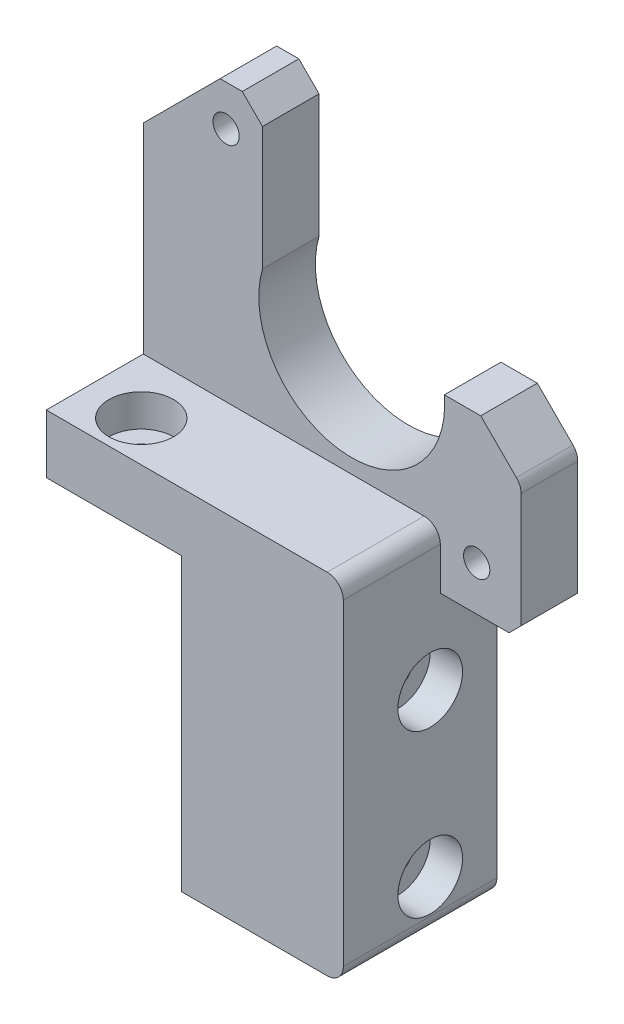
ISO-10303-21;
HEADER;
FILE_DESCRIPTION(('STEP AP214'),'2;1');
FILE_NAME('part.step','',(''),(''),'','','');
FILE_SCHEMA(('AUTOMOTIVE_DESIGN { 1 0 10303 214 1 1 1 1 }'));
ENDSEC;
DATA;
#1=APPLICATION_CONTEXT('core data for automotive mechanical design processes');
#2=APPLICATION_PROTOCOL_DEFINITION('international standard','automotive_design',2000,#1);
#3=PRODUCT_CONTEXT('',#1,'mechanical');
#4=PRODUCT('Part','Part','',(#3));
#5=PRODUCT_RELATED_PRODUCT_CATEGORY('part','',(#4));
#6=PRODUCT_DEFINITION_FORMATION('','',#4);
#7=PRODUCT_DEFINITION_CONTEXT('part definition',#1,'design');
#8=PRODUCT_DEFINITION('design','',#6,#7);
#9=PRODUCT_DEFINITION_SHAPE('','',#8);
#10=(LENGTH_UNIT() NAMED_UNIT(*) SI_UNIT(.MILLI.,.METRE.));
#11=(NAMED_UNIT(*) PLANE_ANGLE_UNIT() SI_UNIT($,.RADIAN.));
#12=(NAMED_UNIT(*) SI_UNIT($,.STERADIAN.) SOLID_ANGLE_UNIT());
#13=UNCERTAINTY_MEASURE_WITH_UNIT(LENGTH_MEASURE(1.E-05),#10,'distance_accuracy_value','');
#14=(GEOMETRIC_REPRESENTATION_CONTEXT(3) GLOBAL_UNCERTAINTY_ASSIGNED_CONTEXT((#13)) GLOBAL_UNIT_ASSIGNED_CONTEXT((#10,
#11,#12)) REPRESENTATION_CONTEXT('',''));
#15=CARTESIAN_POINT('',(0.,0.,0.));
#16=DIRECTION('',(0.,0.,1.));
#17=DIRECTION('',(1.,0.,0.));
#18=AXIS2_PLACEMENT_3D('',#15,#16,#17);
#19=CARTESIAN_POINT('',(-10.,46.,14.));
#20=DIRECTION('',(0.,-1.,0.));
#21=DIRECTION('',(0.,0.,-1.));
#22=AXIS2_PLACEMENT_3D('',#19,#20,#21);
#23=CYLINDRICAL_SURFACE('',#22,1.75);
#24=CARTESIAN_POINT('',(-10.,36.,14.));
#25=DIRECTION('',(0.,-1.,0.));
#26=DIRECTION('',(0.,0.,-1.));
#27=AXIS2_PLACEMENT_3D('',#24,#25,#26);
#28=CIRCLE('',#27,1.75);
#29=CARTESIAN_POINT('',(-10.,36.,12.25));
#30=VERTEX_POINT('',#29);
#31=EDGE_CURVE('E490',#30,#30,#28,.T.);
#32=ORIENTED_EDGE('',*,*,#31,.T.);
#33=EDGE_LOOP('',(#32));
#34=FACE_BOUND('',#33,.T.);
#35=CARTESIAN_POINT('',(-10.,39.25,14.));
#36=DIRECTION('',(0.,1.,0.));
#37=DIRECTION('',(-1.,0.,0.));
#38=AXIS2_PLACEMENT_3D('',#35,#36,#37);
#39=CIRCLE('',#38,1.75);
#40=CARTESIAN_POINT('',(-11.75,39.25,14.));
#41=VERTEX_POINT('',#40);
#42=EDGE_CURVE('E39',#41,#41,#39,.F.);
#43=ORIENTED_EDGE('',*,*,#42,.F.);
#44=EDGE_LOOP('',(#43));
#45=FACE_BOUND('',#44,.T.);
#46=ADVANCED_FACE('F35',(#34,#45),#23,.F.);
#47=CARTESIAN_POINT('',(-16.75,6.25000000000001,8.25));
#48=DIRECTION('',(1.,0.,0.));
#49=DIRECTION('',(0.,0.,-1.));
#50=AXIS2_PLACEMENT_3D('',#47,#48,#49);
#51=CYLINDRICAL_SURFACE('',#50,1.75);
#52=CARTESIAN_POINT('',(0.,6.25000000000001,8.25));
#53=DIRECTION('',(1.,0.,0.));
#54=DIRECTION('',(0.,1.,0.));
#55=AXIS2_PLACEMENT_3D('',#52,#53,#54);
#56=CIRCLE('',#55,1.75);
#57=CARTESIAN_POINT('',(0.,8.00000000000001,8.25));
#58=VERTEX_POINT('',#57);
#59=EDGE_CURVE('E321',#58,#58,#56,.T.);
#60=ORIENTED_EDGE('',*,*,#59,.F.);
#61=EDGE_LOOP('',(#60));
#62=FACE_BOUND('',#61,.T.);
#63=CARTESIAN_POINT('',(16.,6.25000000000001,8.25));
#64=DIRECTION('',(1.,0.,0.));
#65=DIRECTION('',(0.,0.,-1.));
#66=AXIS2_PLACEMENT_3D('',#63,#64,#65);
#67=CIRCLE('',#66,1.75);
#68=CARTESIAN_POINT('',(16.,6.25000000000001,6.5));
#69=VERTEX_POINT('',#68);
#70=EDGE_CURVE('E317',#69,#69,#67,.F.);
#71=ORIENTED_EDGE('',*,*,#70,.F.);
#72=EDGE_LOOP('',(#71));
#73=FACE_BOUND('',#72,.T.);
#74=ADVANCED_FACE('F398',(#62,#73),#51,.F.);
#75=CARTESIAN_POINT('',(-16.75,26.25,8.25));
#76=DIRECTION('',(1.,0.,0.));
#77=DIRECTION('',(0.,0.,-1.));
#78=AXIS2_PLACEMENT_3D('',#75,#76,#77);
#79=CYLINDRICAL_SURFACE('',#78,1.75);
#80=CARTESIAN_POINT('',(0.,26.25,8.25));
#81=DIRECTION('',(1.,0.,0.));
#82=DIRECTION('',(0.,1.,0.));
#83=AXIS2_PLACEMENT_3D('',#80,#81,#82);
#84=CIRCLE('',#83,1.75);
#85=CARTESIAN_POINT('',(0.,28.,8.25));
#86=VERTEX_POINT('',#85);
#87=EDGE_CURVE('E228',#86,#86,#84,.T.);
#88=ORIENTED_EDGE('',*,*,#87,.F.);
#89=EDGE_LOOP('',(#88));
#90=FACE_BOUND('',#89,.T.);
#91=CARTESIAN_POINT('',(16.,26.25,8.25));
#92=DIRECTION('',(1.,0.,0.));
#93=DIRECTION('',(0.,0.,-1.));
#94=AXIS2_PLACEMENT_3D('',#91,#92,#93);
#95=CIRCLE('',#94,1.75);
#96=CARTESIAN_POINT('',(16.,26.25,6.5));
#97=VERTEX_POINT('',#96);
#98=EDGE_CURVE('E314',#97,#97,#95,.F.);
#99=ORIENTED_EDGE('',*,*,#98,.F.);
#100=EDGE_LOOP('',(#99));
#101=FACE_BOUND('',#100,.T.);
#102=ADVANCED_FACE('F405',(#90,#101),#79,.F.);
#103=CARTESIAN_POINT('',(20.,43.25,19.));
#104=DIRECTION('',(0.,-1.,0.));
#105=DIRECTION('',(1.,0.,0.));
#106=AXIS2_PLACEMENT_3D('',#103,#104,#105);
#107=PLANE('',#106);
#108=CARTESIAN_POINT('',(-10.,43.25,14.));
#109=DIRECTION('',(0.,1.,0.));
#110=DIRECTION('',(-1.,0.,0.));
#111=AXIS2_PLACEMENT_3D('',#108,#109,#110);
#112=CIRCLE('',#111,4.);
#113=CARTESIAN_POINT('',(-14.,43.25,14.));
#114=VERTEX_POINT('',#113);
#115=EDGE_CURVE('E547',#114,#114,#112,.T.);
#116=ORIENTED_EDGE('',*,*,#115,.F.);
#117=EDGE_LOOP('',(#116));
#118=FACE_BOUND('',#117,.T.);
#119=DIRECTION('',(-1.,0.,0.));
#120=VECTOR('',#119,1.);
#121=CARTESIAN_POINT('',(20.,43.25,19.));
#122=LINE('',#121,#120);
#123=CARTESIAN_POINT('',(18.,43.25,19.));
#124=VERTEX_POINT('',#123);
#125=CARTESIAN_POINT('',(-16.75,43.25,19.));
#126=VERTEX_POINT('',#125);
#127=EDGE_CURVE('E288',#124,#126,#122,.T.);
#128=ORIENTED_EDGE('',*,*,#127,.F.);
#129=DIRECTION('',(0.,0.,-1.));
#130=VECTOR('',#129,1.);
#131=CARTESIAN_POINT('',(18.,43.25,19.));
#132=LINE('',#131,#130);
#133=CARTESIAN_POINT('',(18.,43.25,7.));
#134=VERTEX_POINT('',#133);
#135=EDGE_CURVE('E44',#124,#134,#132,.T.);
#136=ORIENTED_EDGE('',*,*,#135,.T.);
#137=DIRECTION('',(1.,0.,0.));
#138=VECTOR('',#137,1.);
#139=CARTESIAN_POINT('',(20.,43.25,7.));
#140=LINE('',#139,#138);
#141=CARTESIAN_POINT('',(-16.75,43.25,7.));
#142=VERTEX_POINT('',#141);
#143=EDGE_CURVE('E273',#142,#134,#140,.T.);
#144=ORIENTED_EDGE('',*,*,#143,.F.);
#145=DIRECTION('',(0.,0.,-1.));
#146=VECTOR('',#145,1.);
#147=CARTESIAN_POINT('',(-16.75,43.25,19.));
#148=LINE('',#147,#146);
#149=EDGE_CURVE('E182',#126,#142,#148,.T.);
#150=ORIENTED_EDGE('',*,*,#149,.F.);
#151=EDGE_LOOP('',(#128,#136,#144,#150));
#152=FACE_BOUND('',#151,.T.);
#153=ADVANCED_FACE('F352',(#118,#152),#107,.F.);
#154=CARTESIAN_POINT('',(0.,36.,19.));
#155=DIRECTION('',(1.,0.,0.));
#156=DIRECTION('',(0.,1.,0.));
#157=AXIS2_PLACEMENT_3D('',#154,#155,#156);
#158=PLANE('',#157);
#159=ORIENTED_EDGE('',*,*,#87,.T.);
#160=EDGE_LOOP('',(#159));
#161=FACE_BOUND('',#160,.T.);
#162=ORIENTED_EDGE('',*,*,#59,.T.);
#163=EDGE_LOOP('',(#162));
#164=FACE_BOUND('',#163,.T.);
#165=DIRECTION('',(0.,-1.,0.));
#166=VECTOR('',#165,1.);
#167=CARTESIAN_POINT('',(0.,36.,0.));
#168=LINE('',#167,#166);
#169=CARTESIAN_POINT('',(0.,36.,0.));
#170=VERTEX_POINT('',#169);
#171=CARTESIAN_POINT('',(0.,0.,0.));
#172=VERTEX_POINT('',#171);
#173=EDGE_CURVE('E277',#170,#172,#168,.T.);
#174=ORIENTED_EDGE('',*,*,#173,.T.);
#175=DIRECTION('',(0.,0.,-1.));
#176=VECTOR('',#175,1.);
#177=CARTESIAN_POINT('',(0.,0.,19.));
#178=LINE('',#177,#176);
#179=CARTESIAN_POINT('',(0.,0.,19.));
#180=VERTEX_POINT('',#179);
#181=EDGE_CURVE('E310',#180,#172,#178,.T.);
#182=ORIENTED_EDGE('',*,*,#181,.F.);
#183=DIRECTION('',(0.,-1.,0.));
#184=VECTOR('',#183,1.);
#185=CARTESIAN_POINT('',(0.,36.,19.));
#186=LINE('',#185,#184);
#187=CARTESIAN_POINT('',(0.,36.,19.));
#188=VERTEX_POINT('',#187);
#189=EDGE_CURVE('E278',#188,#180,#186,.T.);
#190=ORIENTED_EDGE('',*,*,#189,.F.);
#191=DIRECTION('',(0.,0.,-1.));
#192=VECTOR('',#191,1.);
#193=CARTESIAN_POINT('',(0.,36.,19.));
#194=LINE('',#193,#192);
#195=EDGE_CURVE('E294',#188,#170,#194,.T.);
#196=ORIENTED_EDGE('',*,*,#195,.T.);
#197=EDGE_LOOP('',(#174,#182,#190,#196));
#198=FACE_BOUND('',#197,.T.);
#199=ADVANCED_FACE('F377',(#161,#164,#198),#158,.F.);
#200=CARTESIAN_POINT('',(0.,0.,19.));
#201=DIRECTION('',(0.,1.,0.));
#202=DIRECTION('',(0.,0.,1.));
#203=AXIS2_PLACEMENT_3D('',#200,#201,#202);
#204=PLANE('',#203);
#205=DIRECTION('',(1.,0.,0.));
#206=VECTOR('',#205,1.);
#207=CARTESIAN_POINT('',(0.,0.,0.));
#208=LINE('',#207,#206);
#209=CARTESIAN_POINT('',(18.,0.,0.));
#210=VERTEX_POINT('',#209);
#211=EDGE_CURVE('E297',#172,#210,#208,.T.);
#212=ORIENTED_EDGE('',*,*,#211,.T.);
#213=DIRECTION('',(0.,0.,-1.));
#214=VECTOR('',#213,1.);
#215=CARTESIAN_POINT('',(18.,0.,19.));
#216=LINE('',#215,#214);
#217=CARTESIAN_POINT('',(18.,0.,19.));
#218=VERTEX_POINT('',#217);
#219=EDGE_CURVE('E338',#210,#218,#216,.F.);
#220=ORIENTED_EDGE('',*,*,#219,.T.);
#221=DIRECTION('',(1.,0.,0.));
#222=VECTOR('',#221,1.);
#223=CARTESIAN_POINT('',(0.,0.,19.));
#224=LINE('',#223,#222);
#225=EDGE_CURVE('E281',#180,#218,#224,.T.);
#226=ORIENTED_EDGE('',*,*,#225,.F.);
#227=ORIENTED_EDGE('',*,*,#181,.T.);
#228=EDGE_LOOP('',(#212,#220,#226,#227));
#229=FACE_BOUND('',#228,.T.);
#230=ADVANCED_FACE('F373',(#229),#204,.F.);
#231=CARTESIAN_POINT('',(20.,0.,19.));
#232=DIRECTION('',(-1.,0.,0.));
#233=DIRECTION('',(0.,0.,1.));
#234=AXIS2_PLACEMENT_3D('',#231,#232,#233);
#235=PLANE('',#234);
#236=CARTESIAN_POINT('',(20.,26.25,8.25));
#237=DIRECTION('',(1.,0.,0.));
#238=DIRECTION('',(0.,0.,-1.));
#239=AXIS2_PLACEMENT_3D('',#236,#237,#238);
#240=CIRCLE('',#239,4.);
#241=CARTESIAN_POINT('',(20.,26.25,4.25));
#242=VERTEX_POINT('',#241);
#243=EDGE_CURVE('E497',#242,#242,#240,.T.);
#244=ORIENTED_EDGE('',*,*,#243,.F.);
#245=EDGE_LOOP('',(#244));
#246=FACE_BOUND('',#245,.T.);
#247=CARTESIAN_POINT('',(20.,6.25000000000001,8.25));
#248=DIRECTION('',(1.,0.,0.));
#249=DIRECTION('',(0.,0.,-1.));
#250=AXIS2_PLACEMENT_3D('',#247,#248,#249);
#251=CIRCLE('',#250,4.);
#252=CARTESIAN_POINT('',(20.,6.25000000000001,4.25));
#253=VERTEX_POINT('',#252);
#254=EDGE_CURVE('E329',#253,#253,#251,.T.);
#255=ORIENTED_EDGE('',*,*,#254,.F.);
#256=EDGE_LOOP('',(#255));
#257=FACE_BOUND('',#256,.T.);
#258=DIRECTION('',(0.,1.,0.));
#259=VECTOR('',#258,1.);
#260=CARTESIAN_POINT('',(20.,0.,19.));
#261=LINE('',#260,#259);
#262=CARTESIAN_POINT('',(20.,2.,19.));
#263=VERTEX_POINT('',#262);
#264=CARTESIAN_POINT('',(20.,41.25,19.));
#265=VERTEX_POINT('',#264);
#266=EDGE_CURVE('E285',#263,#265,#261,.T.);
#267=ORIENTED_EDGE('',*,*,#266,.F.);
#268=DIRECTION('',(0.,0.,-1.));
#269=VECTOR('',#268,1.);
#270=CARTESIAN_POINT('',(20.,2.,19.));
#271=LINE('',#270,#269);
#272=CARTESIAN_POINT('',(20.,2.00000000000002,0.));
#273=VERTEX_POINT('',#272);
#274=EDGE_CURVE('E331',#263,#273,#271,.T.);
#275=ORIENTED_EDGE('',*,*,#274,.T.);
#276=DIRECTION('',(0.,1.,0.));
#277=VECTOR('',#276,1.);
#278=CARTESIAN_POINT('',(20.,0.,0.));
#279=LINE('',#278,#277);
#280=CARTESIAN_POINT('',(20.,36.,0.));
#281=VERTEX_POINT('',#280);
#282=EDGE_CURVE('E300',#273,#281,#279,.T.);
#283=ORIENTED_EDGE('',*,*,#282,.T.);
#284=DIRECTION('',(0.,0.,1.));
#285=VECTOR('',#284,1.);
#286=CARTESIAN_POINT('',(20.,36.,19.));
#287=LINE('',#286,#285);
#288=CARTESIAN_POINT('',(20.,36.,7.));
#289=VERTEX_POINT('',#288);
#290=EDGE_CURVE('E256',#281,#289,#287,.T.);
#291=ORIENTED_EDGE('',*,*,#290,.T.);
#292=DIRECTION('',(0.,-1.,0.));
#293=VECTOR('',#292,1.);
#294=CARTESIAN_POINT('',(20.,0.,7.));
#295=LINE('',#294,#293);
#296=CARTESIAN_POINT('',(20.,41.25,7.));
#297=VERTEX_POINT('',#296);
#298=EDGE_CURVE('E275',#297,#289,#295,.T.);
#299=ORIENTED_EDGE('',*,*,#298,.F.);
#300=DIRECTION('',(0.,0.,-1.));
#301=VECTOR('',#300,1.);
#302=CARTESIAN_POINT('',(20.,41.25,19.));
#303=LINE('',#302,#301);
#304=EDGE_CURVE('E313',#297,#265,#303,.F.);
#305=ORIENTED_EDGE('',*,*,#304,.T.);
#306=EDGE_LOOP('',(#267,#275,#283,#291,#299,#305));
#307=FACE_BOUND('',#306,.T.);
#308=ADVANCED_FACE('F358',(#246,#257,#307),#235,.F.);
#309=CARTESIAN_POINT('',(-16.75,43.25,19.));
#310=DIRECTION('',(1.,0.,0.));
#311=DIRECTION('',(0.,1.,0.));
#312=AXIS2_PLACEMENT_3D('',#309,#310,#311);
#313=PLANE('',#312);
#314=DIRECTION('',(0.,-1.,0.));
#315=VECTOR('',#314,1.);
#316=CARTESIAN_POINT('',(-16.75,43.25,0.));
#317=LINE('',#316,#315);
#318=CARTESIAN_POINT('',(-16.75,68.,0.));
#319=VERTEX_POINT('',#318);
#320=CARTESIAN_POINT('',(-16.75,36.,0.));
#321=VERTEX_POINT('',#320);
#322=EDGE_CURVE('E302',#319,#321,#317,.T.);
#323=ORIENTED_EDGE('',*,*,#322,.T.);
#324=DIRECTION('',(0.,0.,-1.));
#325=VECTOR('',#324,1.);
#326=CARTESIAN_POINT('',(-16.75,36.,19.));
#327=LINE('',#326,#325);
#328=CARTESIAN_POINT('',(-16.75,36.,19.));
#329=VERTEX_POINT('',#328);
#330=EDGE_CURVE('E307',#329,#321,#327,.T.);
#331=ORIENTED_EDGE('',*,*,#330,.F.);
#332=DIRECTION('',(0.,-1.,0.));
#333=VECTOR('',#332,1.);
#334=CARTESIAN_POINT('',(-16.75,43.25,19.));
#335=LINE('',#334,#333);
#336=EDGE_CURVE('E290',#126,#329,#335,.T.);
#337=ORIENTED_EDGE('',*,*,#336,.F.);
#338=ORIENTED_EDGE('',*,*,#149,.T.);
#339=DIRECTION('',(0.,1.,0.));
#340=VECTOR('',#339,1.);
#341=CARTESIAN_POINT('',(-16.75,36.,7.));
#342=LINE('',#341,#340);
#343=CARTESIAN_POINT('',(-16.75,68.,7.));
#344=VERTEX_POINT('',#343);
#345=EDGE_CURVE('E174',#142,#344,#342,.T.);
#346=ORIENTED_EDGE('',*,*,#345,.T.);
#347=DIRECTION('',(0.,0.,-1.));
#348=VECTOR('',#347,1.);
#349=CARTESIAN_POINT('',(-16.75,68.,7.));
#350=LINE('',#349,#348);
#351=EDGE_CURVE('E178',#344,#319,#350,.T.);
#352=ORIENTED_EDGE('',*,*,#351,.T.);
#353=EDGE_LOOP('',(#323,#331,#337,#338,#346,#352));
#354=FACE_BOUND('',#353,.T.);
#355=ADVANCED_FACE('F177',(#354),#313,.F.);
#356=CARTESIAN_POINT('',(-16.75,36.,19.));
#357=DIRECTION('',(0.,1.,0.));
#358=DIRECTION('',(0.,0.,1.));
#359=AXIS2_PLACEMENT_3D('',#356,#357,#358);
#360=PLANE('',#359);
#361=ORIENTED_EDGE('',*,*,#31,.F.);
#362=EDGE_LOOP('',(#361));
#363=FACE_BOUND('',#362,.T.);
#364=DIRECTION('',(1.,0.,0.));
#365=VECTOR('',#364,1.);
#366=CARTESIAN_POINT('',(-16.75,36.,0.));
#367=LINE('',#366,#365);
#368=EDGE_CURVE('E282',#321,#170,#367,.T.);
#369=ORIENTED_EDGE('',*,*,#368,.T.);
#370=ORIENTED_EDGE('',*,*,#195,.F.);
#371=DIRECTION('',(1.,0.,0.));
#372=VECTOR('',#371,1.);
#373=CARTESIAN_POINT('',(-16.75,36.,19.));
#374=LINE('',#373,#372);
#375=EDGE_CURVE('E292',#329,#188,#374,.T.);
#376=ORIENTED_EDGE('',*,*,#375,.F.);
#377=ORIENTED_EDGE('',*,*,#330,.T.);
#378=EDGE_LOOP('',(#369,#370,#376,#377));
#379=FACE_BOUND('',#378,.T.);
#380=ADVANCED_FACE('F381',(#363,#379),#360,.F.);
#381=CARTESIAN_POINT('',(0.,0.,19.));
#382=DIRECTION('',(0.,0.,1.));
#383=DIRECTION('',(1.,0.,0.));
#384=AXIS2_PLACEMENT_3D('',#381,#382,#383);
#385=PLANE('',#384);
#386=ORIENTED_EDGE('',*,*,#225,.T.);
#387=CARTESIAN_POINT('',(18.,2.,19.));
#388=DIRECTION('',(0.,0.,1.));
#389=DIRECTION('',(1.,0.,0.));
#390=AXIS2_PLACEMENT_3D('',#387,#388,#389);
#391=CIRCLE('',#390,2.);
#392=EDGE_CURVE('E342',#218,#263,#391,.T.);
#393=ORIENTED_EDGE('',*,*,#392,.T.);
#394=ORIENTED_EDGE('',*,*,#266,.T.);
#395=CARTESIAN_POINT('',(18.,41.25,19.));
#396=DIRECTION('',(0.,0.,1.));
#397=DIRECTION('',(1.,0.,0.));
#398=AXIS2_PLACEMENT_3D('',#395,#396,#397);
#399=CIRCLE('',#398,2.);
#400=EDGE_CURVE('E340',#265,#124,#399,.T.);
#401=ORIENTED_EDGE('',*,*,#400,.T.);
#402=ORIENTED_EDGE('',*,*,#127,.T.);
#403=ORIENTED_EDGE('',*,*,#336,.T.);
#404=ORIENTED_EDGE('',*,*,#375,.T.);
#405=ORIENTED_EDGE('',*,*,#189,.T.);
#406=EDGE_LOOP('',(#386,#393,#394,#401,#402,#403,#404,#405));
#407=FACE_BOUND('',#406,.T.);
#408=ADVANCED_FACE('F362',(#407),#385,.T.);
#409=CARTESIAN_POINT('',(0.,0.,0.));
#410=DIRECTION('',(0.,0.,1.));
#411=DIRECTION('',(1.,0.,0.));
#412=AXIS2_PLACEMENT_3D('',#409,#410,#411);
#413=PLANE('',#412);
#414=CARTESIAN_POINT('',(-6.49999999999999,72.5,0.));
#415=DIRECTION('',(0.,0.,-1.));
#416=DIRECTION('',(-1.,0.,0.));
#417=AXIS2_PLACEMENT_3D('',#414,#415,#416);
#418=CIRCLE('',#417,1.625);
#419=CARTESIAN_POINT('',(-8.12499999999999,72.5,0.));
#420=VERTEX_POINT('',#419);
#421=EDGE_CURVE('E326',#420,#420,#418,.T.);
#422=ORIENTED_EDGE('',*,*,#421,.F.);
#423=EDGE_LOOP('',(#422));
#424=FACE_BOUND('',#423,.T.);
#425=CARTESIAN_POINT('',(24.5,41.5,0.));
#426=DIRECTION('',(0.,0.,-1.));
#427=DIRECTION('',(-1.,0.,0.));
#428=AXIS2_PLACEMENT_3D('',#425,#426,#427);
#429=CIRCLE('',#428,1.625);
#430=CARTESIAN_POINT('',(22.875,41.5,0.));
#431=VERTEX_POINT('',#430);
#432=EDGE_CURVE('E489',#431,#431,#429,.T.);
#433=ORIENTED_EDGE('',*,*,#432,.F.);
#434=EDGE_LOOP('',(#433));
#435=FACE_BOUND('',#434,.T.);
#436=ORIENTED_EDGE('',*,*,#282,.F.);
#437=CARTESIAN_POINT('',(18.,2.00000000000002,0.));
#438=DIRECTION('',(0.,0.,1.));
#439=DIRECTION('',(1.,0.,0.));
#440=AXIS2_PLACEMENT_3D('',#437,#438,#439);
#441=CIRCLE('',#440,2.);
#442=EDGE_CURVE('E336',#273,#210,#441,.F.);
#443=ORIENTED_EDGE('',*,*,#442,.T.);
#444=ORIENTED_EDGE('',*,*,#211,.F.);
#445=ORIENTED_EDGE('',*,*,#173,.F.);
#446=ORIENTED_EDGE('',*,*,#368,.F.);
#447=ORIENTED_EDGE('',*,*,#322,.F.);
#448=DIRECTION('',(0.707106781186549,0.707106781186546,0.));
#449=VECTOR('',#448,1.);
#450=CARTESIAN_POINT('',(-16.75,68.,0.));
#451=LINE('',#450,#449);
#452=CARTESIAN_POINT('',(-7.24999999999997,77.5,0.));
#453=VERTEX_POINT('',#452);
#454=EDGE_CURVE('E193',#319,#453,#451,.T.);
#455=ORIENTED_EDGE('',*,*,#454,.T.);
#456=DIRECTION('',(1.,0.,0.));
#457=VECTOR('',#456,1.);
#458=CARTESIAN_POINT('',(-7.24999999999997,77.5,0.));
#459=LINE('',#458,#457);
#460=CARTESIAN_POINT('',(-4.49999999999997,77.5,0.));
#461=VERTEX_POINT('',#460);
#462=EDGE_CURVE('E230',#453,#461,#459,.T.);
#463=ORIENTED_EDGE('',*,*,#462,.T.);
#464=DIRECTION('',(0.707106781186545,-0.70710678118655,0.));
#465=VECTOR('',#464,1.);
#466=CARTESIAN_POINT('',(-4.49999999999997,77.5,0.));
#467=LINE('',#466,#465);
#468=CARTESIAN_POINT('',(-1.99999999999998,75.,0.));
#469=VERTEX_POINT('',#468);
#470=EDGE_CURVE('E233',#461,#469,#467,.T.);
#471=ORIENTED_EDGE('',*,*,#470,.T.);
#472=DIRECTION('',(0.,-1.,0.));
#473=VECTOR('',#472,1.);
#474=CARTESIAN_POINT('',(-1.99999999999998,75.,0.));
#475=LINE('',#474,#473);
#476=CARTESIAN_POINT('',(-1.99999999999998,59.75,0.));
#477=VERTEX_POINT('',#476);
#478=EDGE_CURVE('E236',#469,#477,#475,.T.);
#479=ORIENTED_EDGE('',*,*,#478,.T.);
#480=CARTESIAN_POINT('',(9.04076104427223,56.532610442722,0.));
#481=DIRECTION('',(0.,0.,1.));
#482=DIRECTION('',(-1.,0.,0.));
#483=AXIS2_PLACEMENT_3D('',#480,#481,#482);
#484=CIRCLE('',#483,11.5);
#485=CARTESIAN_POINT('',(20.5,57.5,0.));
#486=VERTEX_POINT('',#485);
#487=EDGE_CURVE('E239',#477,#486,#484,.T.);
#488=ORIENTED_EDGE('',*,*,#487,.T.);
#489=DIRECTION('',(1.,0.,0.));
#490=VECTOR('',#489,1.);
#491=CARTESIAN_POINT('',(25.,57.5,0.));
#492=LINE('',#491,#490);
#493=CARTESIAN_POINT('',(25.,57.5,0.));
#494=VERTEX_POINT('',#493);
#495=EDGE_CURVE('E242',#486,#494,#492,.T.);
#496=ORIENTED_EDGE('',*,*,#495,.T.);
#497=DIRECTION('',(0.707106781186546,-0.707106781186549,0.));
#498=VECTOR('',#497,1.);
#499=CARTESIAN_POINT('',(30.,52.5,0.));
#500=LINE('',#499,#498);
#501=CARTESIAN_POINT('',(29.4142135623731,53.0857864376269,0.));
#502=VERTEX_POINT('',#501);
#503=EDGE_CURVE('E245',#494,#502,#500,.T.);
#504=ORIENTED_EDGE('',*,*,#503,.T.);
#505=CARTESIAN_POINT('',(28.,51.6715728752538,0.));
#506=DIRECTION('',(0.,0.,1.));
#507=DIRECTION('',(1.,0.,0.));
#508=AXIS2_PLACEMENT_3D('',#505,#506,#507);
#509=CIRCLE('',#508,2.);
#510=CARTESIAN_POINT('',(30.,51.6715728752538,0.));
#511=VERTEX_POINT('',#510);
#512=EDGE_CURVE('E334',#502,#511,#509,.F.);
#513=ORIENTED_EDGE('',*,*,#512,.T.);
#514=DIRECTION('',(0.,-1.,0.));
#515=VECTOR('',#514,1.);
#516=CARTESIAN_POINT('',(30.,37.5,0.));
#517=LINE('',#516,#515);
#518=CARTESIAN_POINT('',(30.,37.5,0.));
#519=VERTEX_POINT('',#518);
#520=EDGE_CURVE('E248',#511,#519,#517,.T.);
#521=ORIENTED_EDGE('',*,*,#520,.T.);
#522=DIRECTION('',(-0.707106781186549,-0.707106781186546,0.));
#523=VECTOR('',#522,1.);
#524=CARTESIAN_POINT('',(28.5,36.,0.));
#525=LINE('',#524,#523);
#526=CARTESIAN_POINT('',(28.5,36.,0.));
#527=VERTEX_POINT('',#526);
#528=EDGE_CURVE('E250',#519,#527,#525,.T.);
#529=ORIENTED_EDGE('',*,*,#528,.T.);
#530=DIRECTION('',(-1.,0.,0.));
#531=VECTOR('',#530,1.);
#532=CARTESIAN_POINT('',(20.,36.,0.));
#533=LINE('',#532,#531);
#534=EDGE_CURVE('E225',#527,#281,#533,.T.);
#535=ORIENTED_EDGE('',*,*,#534,.T.);
#536=EDGE_LOOP('',(#436,#443,#444,#445,#446,#447,#455,#463,#471,#479,#488,#496,#504,#513,#521,
#529,#535));
#537=FACE_BOUND('',#536,.T.);
#538=ADVANCED_FACE('F370',(#424,#435,#537),#413,.F.);
#539=CARTESIAN_POINT('',(9.04076104427223,56.532610442722,7.));
#540=DIRECTION('',(0.,0.,-1.));
#541=DIRECTION('',(-1.,0.,0.));
#542=AXIS2_PLACEMENT_3D('',#539,#540,#541);
#543=PLANE('',#542);
#544=CARTESIAN_POINT('',(-6.49999999999999,72.5,7.));
#545=DIRECTION('',(0.,0.,-1.));
#546=DIRECTION('',(-1.,0.,0.));
#547=AXIS2_PLACEMENT_3D('',#544,#545,#546);
#548=CIRCLE('',#547,1.625);
#549=CARTESIAN_POINT('',(-8.12499999999999,72.5,7.));
#550=VERTEX_POINT('',#549);
#551=EDGE_CURVE('E325',#550,#550,#548,.T.);
#552=ORIENTED_EDGE('',*,*,#551,.T.);
#553=EDGE_LOOP('',(#552));
#554=FACE_BOUND('',#553,.T.);
#555=CARTESIAN_POINT('',(24.5,41.5,7.));
#556=DIRECTION('',(0.,0.,-1.));
#557=DIRECTION('',(-1.,0.,0.));
#558=AXIS2_PLACEMENT_3D('',#555,#556,#557);
#559=CIRCLE('',#558,1.625);
#560=CARTESIAN_POINT('',(22.875,41.5,7.));
#561=VERTEX_POINT('',#560);
#562=EDGE_CURVE('E322',#561,#561,#559,.T.);
#563=ORIENTED_EDGE('',*,*,#562,.T.);
#564=EDGE_LOOP('',(#563));
#565=FACE_BOUND('',#564,.T.);
#566=DIRECTION('',(0.,-1.,0.));
#567=VECTOR('',#566,1.);
#568=CARTESIAN_POINT('',(30.,37.5,7.));
#569=LINE('',#568,#567);
#570=CARTESIAN_POINT('',(30.,51.6715728752538,7.));
#571=VERTEX_POINT('',#570);
#572=CARTESIAN_POINT('',(30.,37.5,7.));
#573=VERTEX_POINT('',#572);
#574=EDGE_CURVE('E221',#571,#573,#569,.T.);
#575=ORIENTED_EDGE('',*,*,#574,.F.);
#576=CARTESIAN_POINT('',(28.,51.6715728752538,7.));
#577=DIRECTION('',(0.,0.,-1.));
#578=DIRECTION('',(-1.,0.,0.));
#579=AXIS2_PLACEMENT_3D('',#576,#577,#578);
#580=CIRCLE('',#579,2.);
#581=CARTESIAN_POINT('',(29.4142135623731,53.0857864376269,7.));
#582=VERTEX_POINT('',#581);
#583=EDGE_CURVE('E348',#571,#582,#580,.F.);
#584=ORIENTED_EDGE('',*,*,#583,.T.);
#585=DIRECTION('',(0.707106781186546,-0.707106781186549,0.));
#586=VECTOR('',#585,1.);
#587=CARTESIAN_POINT('',(30.,52.5,7.));
#588=LINE('',#587,#586);
#589=CARTESIAN_POINT('',(25.,57.5,7.));
#590=VERTEX_POINT('',#589);
#591=EDGE_CURVE('E218',#590,#582,#588,.T.);
#592=ORIENTED_EDGE('',*,*,#591,.F.);
#593=DIRECTION('',(1.,0.,0.));
#594=VECTOR('',#593,1.);
#595=CARTESIAN_POINT('',(25.,57.5,7.));
#596=LINE('',#595,#594);
#597=CARTESIAN_POINT('',(20.5,57.5,7.));
#598=VERTEX_POINT('',#597);
#599=EDGE_CURVE('E215',#598,#590,#596,.T.);
#600=ORIENTED_EDGE('',*,*,#599,.F.);
#601=CARTESIAN_POINT('',(9.04076104427223,56.532610442722,7.));
#602=DIRECTION('',(0.,0.,1.));
#603=DIRECTION('',(-1.,0.,0.));
#604=AXIS2_PLACEMENT_3D('',#601,#602,#603);
#605=CIRCLE('',#604,11.5);
#606=CARTESIAN_POINT('',(-1.99999999999998,59.75,7.));
#607=VERTEX_POINT('',#606);
#608=EDGE_CURVE('E212',#607,#598,#605,.T.);
#609=ORIENTED_EDGE('',*,*,#608,.F.);
#610=DIRECTION('',(0.,-1.,0.));
#611=VECTOR('',#610,1.);
#612=CARTESIAN_POINT('',(-1.99999999999998,75.,7.));
#613=LINE('',#612,#611);
#614=CARTESIAN_POINT('',(-1.99999999999998,75.,7.));
#615=VERTEX_POINT('',#614);
#616=EDGE_CURVE('E209',#615,#607,#613,.T.);
#617=ORIENTED_EDGE('',*,*,#616,.F.);
#618=DIRECTION('',(0.707106781186545,-0.70710678118655,0.));
#619=VECTOR('',#618,1.);
#620=CARTESIAN_POINT('',(-4.49999999999997,77.5,7.));
#621=LINE('',#620,#619);
#622=CARTESIAN_POINT('',(-4.49999999999997,77.5,7.));
#623=VERTEX_POINT('',#622);
#624=EDGE_CURVE('E203',#623,#615,#621,.T.);
#625=ORIENTED_EDGE('',*,*,#624,.F.);
#626=DIRECTION('',(1.,0.,0.));
#627=VECTOR('',#626,1.);
#628=CARTESIAN_POINT('',(-7.24999999999997,77.5,7.));
#629=LINE('',#628,#627);
#630=CARTESIAN_POINT('',(-7.24999999999997,77.5,7.));
#631=VERTEX_POINT('',#630);
#632=EDGE_CURVE('E201',#631,#623,#629,.T.);
#633=ORIENTED_EDGE('',*,*,#632,.F.);
#634=DIRECTION('',(0.707106781186549,0.707106781186546,0.));
#635=VECTOR('',#634,1.);
#636=CARTESIAN_POINT('',(-16.75,68.,7.));
#637=LINE('',#636,#635);
#638=EDGE_CURVE('E186',#344,#631,#637,.T.);
#639=ORIENTED_EDGE('',*,*,#638,.F.);
#640=ORIENTED_EDGE('',*,*,#345,.F.);
#641=ORIENTED_EDGE('',*,*,#143,.T.);
#642=CARTESIAN_POINT('',(18.,41.25,7.));
#643=DIRECTION('',(0.,0.,-1.));
#644=DIRECTION('',(-1.,0.,0.));
#645=AXIS2_PLACEMENT_3D('',#642,#643,#644);
#646=CIRCLE('',#645,2.);
#647=EDGE_CURVE('E11',#134,#297,#646,.T.);
#648=ORIENTED_EDGE('',*,*,#647,.T.);
#649=ORIENTED_EDGE('',*,*,#298,.T.);
#650=DIRECTION('',(-1.,0.,0.));
#651=VECTOR('',#650,1.);
#652=CARTESIAN_POINT('',(20.,36.,7.));
#653=LINE('',#652,#651);
#654=CARTESIAN_POINT('',(28.5,36.,7.));
#655=VERTEX_POINT('',#654);
#656=EDGE_CURVE('E187',#655,#289,#653,.T.);
#657=ORIENTED_EDGE('',*,*,#656,.F.);
#658=DIRECTION('',(-0.707106781186549,-0.707106781186546,0.));
#659=VECTOR('',#658,1.);
#660=CARTESIAN_POINT('',(28.5,36.,7.));
#661=LINE('',#660,#659);
#662=EDGE_CURVE('E195',#573,#655,#661,.T.);
#663=ORIENTED_EDGE('',*,*,#662,.F.);
#664=EDGE_LOOP('',(#575,#584,#592,#600,#609,#617,#625,#633,#639,#640,#641,#648,#649,#657,#663));
#665=FACE_BOUND('',#664,.T.);
#666=ADVANCED_FACE('F198',(#554,#565,#665),#543,.F.);
#667=CARTESIAN_POINT('',(20.,36.,7.));
#668=DIRECTION('',(0.,-1.,0.));
#669=DIRECTION('',(1.,0.,0.));
#670=AXIS2_PLACEMENT_3D('',#667,#668,#669);
#671=PLANE('',#670);
#672=ORIENTED_EDGE('',*,*,#290,.F.);
#673=ORIENTED_EDGE('',*,*,#534,.F.);
#674=DIRECTION('',(0.,0.,-1.));
#675=VECTOR('',#674,1.);
#676=CARTESIAN_POINT('',(28.5,36.,7.));
#677=LINE('',#676,#675);
#678=EDGE_CURVE('E253',#655,#527,#677,.T.);
#679=ORIENTED_EDGE('',*,*,#678,.F.);
#680=ORIENTED_EDGE('',*,*,#656,.T.);
#681=EDGE_LOOP('',(#672,#673,#679,#680));
#682=FACE_BOUND('',#681,.T.);
#683=ADVANCED_FACE('F443',(#682),#671,.T.);
#684=CARTESIAN_POINT('',(28.5,36.,7.));
#685=DIRECTION('',(0.707106781186546,-0.707106781186549,0.));
#686=DIRECTION('',(0.707106781186549,0.707106781186546,0.));
#687=AXIS2_PLACEMENT_3D('',#684,#685,#686);
#688=PLANE('',#687);
#689=ORIENTED_EDGE('',*,*,#528,.F.);
#690=DIRECTION('',(0.,0.,-1.));
#691=VECTOR('',#690,1.);
#692=CARTESIAN_POINT('',(30.,37.5,7.));
#693=LINE('',#692,#691);
#694=EDGE_CURVE('E257',#573,#519,#693,.T.);
#695=ORIENTED_EDGE('',*,*,#694,.F.);
#696=ORIENTED_EDGE('',*,*,#662,.T.);
#697=ORIENTED_EDGE('',*,*,#678,.T.);
#698=EDGE_LOOP('',(#689,#695,#696,#697));
#699=FACE_BOUND('',#698,.T.);
#700=ADVANCED_FACE('F445',(#699),#688,.T.);
#701=CARTESIAN_POINT('',(30.,37.5,7.));
#702=DIRECTION('',(1.,0.,0.));
#703=DIRECTION('',(0.,0.,-1.));
#704=AXIS2_PLACEMENT_3D('',#701,#702,#703);
#705=PLANE('',#704);
#706=ORIENTED_EDGE('',*,*,#520,.F.);
#707=DIRECTION('',(0.,0.,-1.));
#708=VECTOR('',#707,1.);
#709=CARTESIAN_POINT('',(30.,51.6715728752538,7.));
#710=LINE('',#709,#708);
#711=EDGE_CURVE('E57',#511,#571,#710,.F.);
#712=ORIENTED_EDGE('',*,*,#711,.T.);
#713=ORIENTED_EDGE('',*,*,#574,.T.);
#714=ORIENTED_EDGE('',*,*,#694,.T.);
#715=EDGE_LOOP('',(#706,#712,#713,#714));
#716=FACE_BOUND('',#715,.T.);
#717=ADVANCED_FACE('F448',(#716),#705,.T.);
#718=CARTESIAN_POINT('',(30.,52.5,7.));
#719=DIRECTION('',(0.707106781186549,0.707106781186546,0.));
#720=DIRECTION('',(-0.707106781186546,0.707106781186549,0.));
#721=AXIS2_PLACEMENT_3D('',#718,#719,#720);
#722=PLANE('',#721);
#723=ORIENTED_EDGE('',*,*,#591,.T.);
#724=DIRECTION('',(0.,0.,-1.));
#725=VECTOR('',#724,1.);
#726=CARTESIAN_POINT('',(29.4142135623731,53.0857864376269,7.));
#727=LINE('',#726,#725);
#728=EDGE_CURVE('E344',#582,#502,#727,.T.);
#729=ORIENTED_EDGE('',*,*,#728,.T.);
#730=ORIENTED_EDGE('',*,*,#503,.F.);
#731=DIRECTION('',(0.,0.,-1.));
#732=VECTOR('',#731,1.);
#733=CARTESIAN_POINT('',(25.,57.5,7.));
#734=LINE('',#733,#732);
#735=EDGE_CURVE('E260',#590,#494,#734,.T.);
#736=ORIENTED_EDGE('',*,*,#735,.F.);
#737=EDGE_LOOP('',(#723,#729,#730,#736));
#738=FACE_BOUND('',#737,.T.);
#739=ADVANCED_FACE('F452',(#738),#722,.T.);
#740=CARTESIAN_POINT('',(25.,57.5,7.));
#741=DIRECTION('',(0.,1.,0.));
#742=DIRECTION('',(-1.,0.,0.));
#743=AXIS2_PLACEMENT_3D('',#740,#741,#742);
#744=PLANE('',#743);
#745=ORIENTED_EDGE('',*,*,#495,.F.);
#746=DIRECTION('',(0.,0.,-1.));
#747=VECTOR('',#746,1.);
#748=CARTESIAN_POINT('',(20.5,57.5,7.));
#749=LINE('',#748,#747);
#750=EDGE_CURVE('E262',#598,#486,#749,.T.);
#751=ORIENTED_EDGE('',*,*,#750,.F.);
#752=ORIENTED_EDGE('',*,*,#599,.T.);
#753=ORIENTED_EDGE('',*,*,#735,.T.);
#754=EDGE_LOOP('',(#745,#751,#752,#753));
#755=FACE_BOUND('',#754,.T.);
#756=ADVANCED_FACE('F455',(#755),#744,.T.);
#757=CARTESIAN_POINT('',(9.04076104427223,56.532610442722,7.));
#758=DIRECTION('',(0.,0.,-1.));
#759=DIRECTION('',(-1.,0.,0.));
#760=AXIS2_PLACEMENT_3D('',#757,#758,#759);
#761=CYLINDRICAL_SURFACE('',#760,11.5);
#762=ORIENTED_EDGE('',*,*,#487,.F.);
#763=DIRECTION('',(0.,0.,-1.));
#764=VECTOR('',#763,1.);
#765=CARTESIAN_POINT('',(-1.99999999999998,59.75,7.));
#766=LINE('',#765,#764);
#767=EDGE_CURVE('E264',#607,#477,#766,.T.);
#768=ORIENTED_EDGE('',*,*,#767,.F.);
#769=ORIENTED_EDGE('',*,*,#608,.T.);
#770=ORIENTED_EDGE('',*,*,#750,.T.);
#771=EDGE_LOOP('',(#762,#768,#769,#770));
#772=FACE_BOUND('',#771,.T.);
#773=ADVANCED_FACE('F459',(#772),#761,.F.);
#774=CARTESIAN_POINT('',(-1.99999999999998,75.,7.));
#775=DIRECTION('',(1.,0.,0.));
#776=DIRECTION('',(0.,1.,0.));
#777=AXIS2_PLACEMENT_3D('',#774,#775,#776);
#778=PLANE('',#777);
#779=ORIENTED_EDGE('',*,*,#478,.F.);
#780=DIRECTION('',(0.,0.,-1.));
#781=VECTOR('',#780,1.);
#782=CARTESIAN_POINT('',(-1.99999999999998,75.,7.));
#783=LINE('',#782,#781);
#784=EDGE_CURVE('E266',#615,#469,#783,.T.);
#785=ORIENTED_EDGE('',*,*,#784,.F.);
#786=ORIENTED_EDGE('',*,*,#616,.T.);
#787=ORIENTED_EDGE('',*,*,#767,.T.);
#788=EDGE_LOOP('',(#779,#785,#786,#787));
#789=FACE_BOUND('',#788,.T.);
#790=ADVANCED_FACE('F463',(#789),#778,.T.);
#791=CARTESIAN_POINT('',(-4.49999999999997,77.5,7.));
#792=DIRECTION('',(0.70710678118655,0.707106781186545,0.));
#793=DIRECTION('',(-0.707106781186545,0.70710678118655,0.));
#794=AXIS2_PLACEMENT_3D('',#791,#792,#793);
#795=PLANE('',#794);
#796=ORIENTED_EDGE('',*,*,#470,.F.);
#797=DIRECTION('',(0.,0.,-1.));
#798=VECTOR('',#797,1.);
#799=CARTESIAN_POINT('',(-4.49999999999997,77.5,7.));
#800=LINE('',#799,#798);
#801=EDGE_CURVE('E268',#623,#461,#800,.T.);
#802=ORIENTED_EDGE('',*,*,#801,.F.);
#803=ORIENTED_EDGE('',*,*,#624,.T.);
#804=ORIENTED_EDGE('',*,*,#784,.T.);
#805=EDGE_LOOP('',(#796,#802,#803,#804));
#806=FACE_BOUND('',#805,.T.);
#807=ADVANCED_FACE('F467',(#806),#795,.T.);
#808=CARTESIAN_POINT('',(-7.24999999999997,77.5,7.));
#809=DIRECTION('',(0.,1.,0.));
#810=DIRECTION('',(0.,0.,1.));
#811=AXIS2_PLACEMENT_3D('',#808,#809,#810);
#812=PLANE('',#811);
#813=ORIENTED_EDGE('',*,*,#462,.F.);
#814=DIRECTION('',(0.,0.,-1.));
#815=VECTOR('',#814,1.);
#816=CARTESIAN_POINT('',(-7.24999999999997,77.5,7.));
#817=LINE('',#816,#815);
#818=EDGE_CURVE('E194',#631,#453,#817,.T.);
#819=ORIENTED_EDGE('',*,*,#818,.F.);
#820=ORIENTED_EDGE('',*,*,#632,.T.);
#821=ORIENTED_EDGE('',*,*,#801,.T.);
#822=EDGE_LOOP('',(#813,#819,#820,#821));
#823=FACE_BOUND('',#822,.T.);
#824=ADVANCED_FACE('F471',(#823),#812,.T.);
#825=CARTESIAN_POINT('',(-16.75,68.,7.));
#826=DIRECTION('',(-0.707106781186546,0.707106781186549,0.));
#827=DIRECTION('',(-0.707106781186549,-0.707106781186546,0.));
#828=AXIS2_PLACEMENT_3D('',#825,#826,#827);
#829=PLANE('',#828);
#830=ORIENTED_EDGE('',*,*,#454,.F.);
#831=ORIENTED_EDGE('',*,*,#351,.F.);
#832=ORIENTED_EDGE('',*,*,#638,.T.);
#833=ORIENTED_EDGE('',*,*,#818,.T.);
#834=EDGE_LOOP('',(#830,#831,#832,#833));
#835=FACE_BOUND('',#834,.T.);
#836=ADVANCED_FACE('F191',(#835),#829,.T.);
#837=CARTESIAN_POINT('',(16.,26.25,8.25));
#838=DIRECTION('',(1.,0.,0.));
#839=DIRECTION('',(0.,0.,-1.));
#840=AXIS2_PLACEMENT_3D('',#837,#838,#839);
#841=PLANE('',#840);
#842=CARTESIAN_POINT('',(16.,26.25,8.25));
#843=DIRECTION('',(1.,0.,0.));
#844=DIRECTION('',(0.,0.,-1.));
#845=AXIS2_PLACEMENT_3D('',#842,#843,#844);
#846=CIRCLE('',#845,4.);
#847=CARTESIAN_POINT('',(16.,26.25,4.25));
#848=VERTEX_POINT('',#847);
#849=EDGE_CURVE('E318',#848,#848,#846,.T.);
#850=ORIENTED_EDGE('',*,*,#849,.T.);
#851=EDGE_LOOP('',(#850));
#852=FACE_BOUND('',#851,.T.);
#853=ORIENTED_EDGE('',*,*,#98,.T.);
#854=EDGE_LOOP('',(#853));
#855=FACE_BOUND('',#854,.T.);
#856=ADVANCED_FACE('F423',(#852,#855),#841,.T.);
#857=CARTESIAN_POINT('',(16.,26.25,8.25));
#858=DIRECTION('',(1.,0.,0.));
#859=DIRECTION('',(0.,0.,-1.));
#860=AXIS2_PLACEMENT_3D('',#857,#858,#859);
#861=CYLINDRICAL_SURFACE('',#860,4.);
#862=ORIENTED_EDGE('',*,*,#849,.F.);
#863=EDGE_LOOP('',(#862));
#864=FACE_BOUND('',#863,.T.);
#865=ORIENTED_EDGE('',*,*,#243,.T.);
#866=EDGE_LOOP('',(#865));
#867=FACE_BOUND('',#866,.T.);
#868=ADVANCED_FACE('F426',(#864,#867),#861,.F.);
#869=CARTESIAN_POINT('',(16.,6.25000000000001,8.25));
#870=DIRECTION('',(1.,0.,0.));
#871=DIRECTION('',(0.,0.,-1.));
#872=AXIS2_PLACEMENT_3D('',#869,#870,#871);
#873=PLANE('',#872);
#874=CARTESIAN_POINT('',(16.,6.25000000000001,8.25));
#875=DIRECTION('',(1.,0.,0.));
#876=DIRECTION('',(0.,0.,-1.));
#877=AXIS2_PLACEMENT_3D('',#874,#875,#876);
#878=CIRCLE('',#877,4.);
#879=CARTESIAN_POINT('',(16.,6.25000000000001,4.25));
#880=VERTEX_POINT('',#879);
#881=EDGE_CURVE('E500',#880,#880,#878,.T.);
#882=ORIENTED_EDGE('',*,*,#881,.T.);
#883=EDGE_LOOP('',(#882));
#884=FACE_BOUND('',#883,.T.);
#885=ORIENTED_EDGE('',*,*,#70,.T.);
#886=EDGE_LOOP('',(#885));
#887=FACE_BOUND('',#886,.T.);
#888=ADVANCED_FACE('F430',(#884,#887),#873,.T.);
#889=CARTESIAN_POINT('',(16.,6.25000000000001,8.25));
#890=DIRECTION('',(1.,0.,0.));
#891=DIRECTION('',(0.,0.,-1.));
#892=AXIS2_PLACEMENT_3D('',#889,#890,#891);
#893=CYLINDRICAL_SURFACE('',#892,4.);
#894=ORIENTED_EDGE('',*,*,#881,.F.);
#895=EDGE_LOOP('',(#894));
#896=FACE_BOUND('',#895,.T.);
#897=ORIENTED_EDGE('',*,*,#254,.T.);
#898=EDGE_LOOP('',(#897));
#899=FACE_BOUND('',#898,.T.);
#900=ADVANCED_FACE('F421',(#896,#899),#893,.F.);
#901=CARTESIAN_POINT('',(24.5,41.5,19.));
#902=DIRECTION('',(0.,0.,-1.));
#903=DIRECTION('',(-1.,0.,0.));
#904=AXIS2_PLACEMENT_3D('',#901,#902,#903);
#905=CYLINDRICAL_SURFACE('',#904,1.625);
#906=ORIENTED_EDGE('',*,*,#432,.T.);
#907=EDGE_LOOP('',(#906));
#908=FACE_BOUND('',#907,.T.);
#909=ORIENTED_EDGE('',*,*,#562,.F.);
#910=EDGE_LOOP('',(#909));
#911=FACE_BOUND('',#910,.T.);
#912=ADVANCED_FACE('F417',(#908,#911),#905,.F.);
#913=CARTESIAN_POINT('',(-6.49999999999999,72.5,19.));
#914=DIRECTION('',(0.,0.,-1.));
#915=DIRECTION('',(-1.,0.,0.));
#916=AXIS2_PLACEMENT_3D('',#913,#914,#915);
#917=CYLINDRICAL_SURFACE('',#916,1.625);
#918=ORIENTED_EDGE('',*,*,#421,.T.);
#919=EDGE_LOOP('',(#918));
#920=FACE_BOUND('',#919,.T.);
#921=ORIENTED_EDGE('',*,*,#551,.F.);
#922=EDGE_LOOP('',(#921));
#923=FACE_BOUND('',#922,.T.);
#924=ADVANCED_FACE('F414',(#920,#923),#917,.F.);
#925=CARTESIAN_POINT('',(18.,2.,19.));
#926=DIRECTION('',(0.,0.,-1.));
#927=DIRECTION('',(-1.,0.,0.));
#928=AXIS2_PLACEMENT_3D('',#925,#926,#927);
#929=CYLINDRICAL_SURFACE('',#928,2.);
#930=ORIENTED_EDGE('',*,*,#392,.F.);
#931=ORIENTED_EDGE('',*,*,#219,.F.);
#932=ORIENTED_EDGE('',*,*,#442,.F.);
#933=ORIENTED_EDGE('',*,*,#274,.F.);
#934=EDGE_LOOP('',(#930,#931,#932,#933));
#935=FACE_BOUND('',#934,.T.);
#936=ADVANCED_FACE('F367',(#935),#929,.T.);
#937=CARTESIAN_POINT('',(28.,51.6715728752538,7.));
#938=DIRECTION('',(0.,0.,-1.));
#939=DIRECTION('',(-1.,0.,0.));
#940=AXIS2_PLACEMENT_3D('',#937,#938,#939);
#941=CYLINDRICAL_SURFACE('',#940,2.);
#942=ORIENTED_EDGE('',*,*,#583,.F.);
#943=ORIENTED_EDGE('',*,*,#711,.F.);
#944=ORIENTED_EDGE('',*,*,#512,.F.);
#945=ORIENTED_EDGE('',*,*,#728,.F.);
#946=EDGE_LOOP('',(#942,#943,#944,#945));
#947=FACE_BOUND('',#946,.T.);
#948=ADVANCED_FACE('F515',(#947),#941,.T.);
#949=CARTESIAN_POINT('',(18.,41.25,19.));
#950=DIRECTION('',(0.,0.,-1.));
#951=DIRECTION('',(-1.,0.,0.));
#952=AXIS2_PLACEMENT_3D('',#949,#950,#951);
#953=CYLINDRICAL_SURFACE('',#952,2.);
#954=ORIENTED_EDGE('',*,*,#400,.F.);
#955=ORIENTED_EDGE('',*,*,#304,.F.);
#956=ORIENTED_EDGE('',*,*,#647,.F.);
#957=ORIENTED_EDGE('',*,*,#135,.F.);
#958=EDGE_LOOP('',(#954,#955,#956,#957));
#959=FACE_BOUND('',#958,.T.);
#960=ADVANCED_FACE('F37',(#959),#953,.T.);
#961=CARTESIAN_POINT('',(-10.,39.25,14.));
#962=DIRECTION('',(0.,1.,0.));
#963=DIRECTION('',(-1.,0.,0.));
#964=AXIS2_PLACEMENT_3D('',#961,#962,#963);
#965=PLANE('',#964);
#966=CARTESIAN_POINT('',(-10.,39.25,14.));
#967=DIRECTION('',(0.,1.,0.));
#968=DIRECTION('',(-1.,0.,0.));
#969=AXIS2_PLACEMENT_3D('',#966,#967,#968);
#970=CIRCLE('',#969,4.);
#971=CARTESIAN_POINT('',(-14.,39.25,14.));
#972=VERTEX_POINT('',#971);
#973=EDGE_CURVE('E549',#972,#972,#970,.T.);
#974=ORIENTED_EDGE('',*,*,#973,.T.);
#975=EDGE_LOOP('',(#974));
#976=FACE_BOUND('',#975,.T.);
#977=ORIENTED_EDGE('',*,*,#42,.T.);
#978=EDGE_LOOP('',(#977));
#979=FACE_BOUND('',#978,.T.);
#980=ADVANCED_FACE('F529',(#976,#979),#965,.T.);
#981=CARTESIAN_POINT('',(-10.,39.25,14.));
#982=DIRECTION('',(0.,1.,0.));
#983=DIRECTION('',(-1.,0.,0.));
#984=AXIS2_PLACEMENT_3D('',#981,#982,#983);
#985=CYLINDRICAL_SURFACE('',#984,4.);
#986=ORIENTED_EDGE('',*,*,#973,.F.);
#987=EDGE_LOOP('',(#986));
#988=FACE_BOUND('',#987,.T.);
#989=ORIENTED_EDGE('',*,*,#115,.T.);
#990=EDGE_LOOP('',(#989));
#991=FACE_BOUND('',#990,.T.);
#992=ADVANCED_FACE('F412',(#988,#991),#985,.F.);
#993=CLOSED_SHELL('',(#46,#74,#102,#153,#199,#230,#308,#355,#380,#408,#538,#666,#683,#700,#717,
#739,#756,#773,#790,#807,#824,#836,#856,#868,#888,#900,#912,#924,#936,#948,#960,#980,#992));
#994=MANIFOLD_SOLID_BREP('B2',#993);
#995=ADVANCED_BREP_SHAPE_REPRESENTATION('',(#18,#994),#14);
#996=SHAPE_DEFINITION_REPRESENTATION(#9,#995);
ENDSEC;
END-ISO-10303-21;
